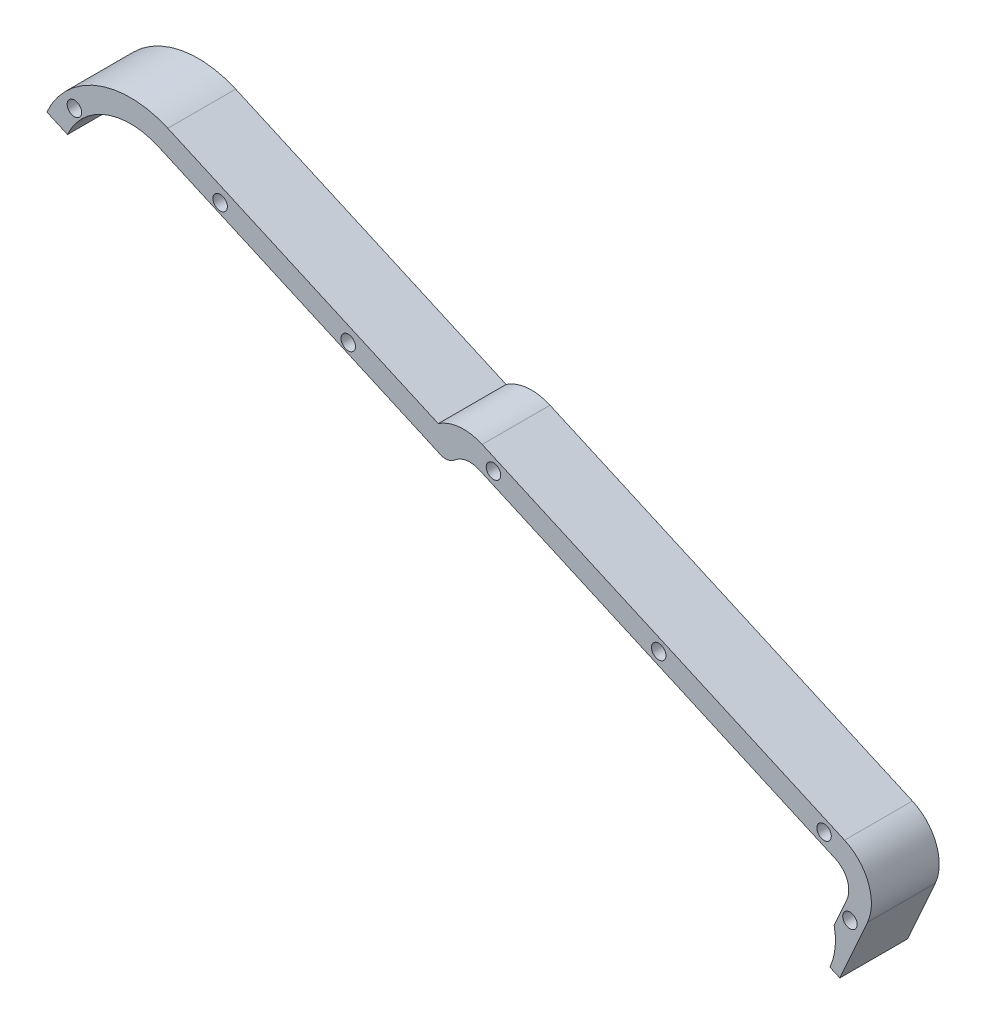
ISO-10303-21;
HEADER;
FILE_DESCRIPTION(('STEP AP214'),'2;1');
FILE_NAME('part.step','',(''),(''),'','','');
FILE_SCHEMA(('AUTOMOTIVE_DESIGN { 1 0 10303 214 1 1 1 1 }'));
ENDSEC;
DATA;
#1=APPLICATION_CONTEXT('core data for automotive mechanical design processes');
#2=APPLICATION_PROTOCOL_DEFINITION('international standard','automotive_design',2000,#1);
#3=PRODUCT_CONTEXT('',#1,'mechanical');
#4=PRODUCT('Part','Part','',(#3));
#5=PRODUCT_RELATED_PRODUCT_CATEGORY('part','',(#4));
#6=PRODUCT_DEFINITION_FORMATION('','',#4);
#7=PRODUCT_DEFINITION_CONTEXT('part definition',#1,'design');
#8=PRODUCT_DEFINITION('design','',#6,#7);
#9=PRODUCT_DEFINITION_SHAPE('','',#8);
#10=(LENGTH_UNIT() NAMED_UNIT(*) SI_UNIT(.MILLI.,.METRE.));
#11=(NAMED_UNIT(*) PLANE_ANGLE_UNIT() SI_UNIT($,.RADIAN.));
#12=(NAMED_UNIT(*) SI_UNIT($,.STERADIAN.) SOLID_ANGLE_UNIT());
#13=UNCERTAINTY_MEASURE_WITH_UNIT(LENGTH_MEASURE(1.E-05),#10,'distance_accuracy_value','');
#14=(GEOMETRIC_REPRESENTATION_CONTEXT(3) GLOBAL_UNCERTAINTY_ASSIGNED_CONTEXT((#13)) GLOBAL_UNIT_ASSIGNED_CONTEXT((#10,
#11,#12)) REPRESENTATION_CONTEXT('',''));
#15=CARTESIAN_POINT('',(0.,0.,0.));
#16=DIRECTION('',(0.,0.,1.));
#17=DIRECTION('',(1.,0.,0.));
#18=AXIS2_PLACEMENT_3D('',#15,#16,#17);
#19=CARTESIAN_POINT('',(-76.7868238041878,81.7037234737728,0.));
#20=DIRECTION('',(0.,0.,1.));
#21=DIRECTION('',(1.,0.,0.));
#22=AXIS2_PLACEMENT_3D('',#19,#20,#21);
#23=CYLINDRICAL_SURFACE('',#22,5.00000000000001);
#24=CARTESIAN_POINT('',(-76.7868238041878,81.7037234737728,15.));
#25=DIRECTION('',(0.,0.,-1.));
#26=DIRECTION('',(-1.,0.,0.));
#27=AXIS2_PLACEMENT_3D('',#24,#25,#26);
#28=CIRCLE('',#27,5.00000000000001);
#29=CARTESIAN_POINT('',(-74.7510627846422,86.27052509759,15.));
#30=VERTEX_POINT('',#29);
#31=CARTESIAN_POINT('',(-72.2200221803707,79.6679624542272,15.));
#32=VERTEX_POINT('',#31);
#33=EDGE_CURVE('E180',#30,#32,#28,.T.);
#34=ORIENTED_EDGE('',*,*,#33,.F.);
#35=DIRECTION('',(0.,0.,1.));
#36=VECTOR('',#35,1.);
#37=CARTESIAN_POINT('',(-74.7510627846422,86.27052509759,0.));
#38=LINE('',#37,#36);
#39=CARTESIAN_POINT('',(-74.7510627846422,86.27052509759,0.));
#40=VERTEX_POINT('',#39);
#41=EDGE_CURVE('E11',#40,#30,#38,.T.);
#42=ORIENTED_EDGE('',*,*,#41,.F.);
#43=CARTESIAN_POINT('',(-76.7868238041878,81.7037234737728,0.));
#44=DIRECTION('',(0.,0.,-1.));
#45=DIRECTION('',(-1.,0.,0.));
#46=AXIS2_PLACEMENT_3D('',#43,#44,#45);
#47=CIRCLE('',#46,5.00000000000001);
#48=CARTESIAN_POINT('',(-72.2200221803707,79.6679624542272,0.));
#49=VERTEX_POINT('',#48);
#50=EDGE_CURVE('E225',#40,#49,#47,.T.);
#51=ORIENTED_EDGE('',*,*,#50,.T.);
#52=DIRECTION('',(0.,0.,1.));
#53=VECTOR('',#52,1.);
#54=CARTESIAN_POINT('',(-72.2200221803707,79.6679624542272,0.));
#55=LINE('',#54,#53);
#56=EDGE_CURVE('E38',#49,#32,#55,.T.);
#57=ORIENTED_EDGE('',*,*,#56,.T.);
#58=EDGE_LOOP('',(#34,#42,#51,#57));
#59=FACE_BOUND('',#58,.T.);
#60=ADVANCED_FACE('F35',(#59),#23,.F.);
#61=CARTESIAN_POINT('',(-153.49279007904,121.371532814155,0.));
#62=DIRECTION('',(-0.40715220390912,-0.913360324763424,0.));
#63=DIRECTION('',(0.913360324763424,-0.40715220390912,0.));
#64=AXIS2_PLACEMENT_3D('',#61,#62,#63);
#65=PLANE('',#64);
#66=DIRECTION('',(0.913360324763424,-0.40715220390912,0.));
#67=VECTOR('',#66,1.);
#68=CARTESIAN_POINT('',(-153.49279007904,121.371532814155,15.));
#69=LINE('',#68,#67);
#70=CARTESIAN_POINT('',(-153.49279007904,121.371532814155,15.));
#71=VERTEX_POINT('',#70);
#72=EDGE_CURVE('E223',#71,#30,#69,.T.);
#73=ORIENTED_EDGE('',*,*,#72,.F.);
#74=DIRECTION('',(0.,0.,1.));
#75=VECTOR('',#74,1.);
#76=CARTESIAN_POINT('',(-153.49279007904,121.371532814155,0.));
#77=LINE('',#76,#75);
#78=CARTESIAN_POINT('',(-153.49279007904,121.371532814155,0.));
#79=VERTEX_POINT('',#78);
#80=EDGE_CURVE('E44',#79,#71,#77,.T.);
#81=ORIENTED_EDGE('',*,*,#80,.F.);
#82=DIRECTION('',(0.913360324763424,-0.40715220390912,0.));
#83=VECTOR('',#82,1.);
#84=CARTESIAN_POINT('',(-153.49279007904,121.371532814155,0.));
#85=LINE('',#84,#83);
#86=EDGE_CURVE('E170',#79,#40,#85,.T.);
#87=ORIENTED_EDGE('',*,*,#86,.T.);
#88=ORIENTED_EDGE('',*,*,#41,.T.);
#89=EDGE_LOOP('',(#73,#81,#87,#88));
#90=FACE_BOUND('',#89,.T.);
#91=ADVANCED_FACE('F253',(#90),#65,.T.);
#92=CARTESIAN_POINT('',(-155.528551098586,116.804731190338,0.));
#93=DIRECTION('',(0.,0.,1.));
#94=DIRECTION('',(1.,0.,0.));
#95=AXIS2_PLACEMENT_3D('',#92,#93,#94);
#96=CYLINDRICAL_SURFACE('',#95,5.00000000000001);
#97=CARTESIAN_POINT('',(-155.528551098586,116.804731190338,15.));
#98=DIRECTION('',(0.,0.,-1.));
#99=DIRECTION('',(-1.,0.,0.));
#100=AXIS2_PLACEMENT_3D('',#97,#98,#99);
#101=CIRCLE('',#100,5.00000000000001);
#102=CARTESIAN_POINT('',(-158.874492831978,120.520195349328,15.));
#103=VERTEX_POINT('',#102);
#104=EDGE_CURVE('E157',#103,#71,#101,.T.);
#105=ORIENTED_EDGE('',*,*,#104,.F.);
#106=DIRECTION('',(0.,0.,1.));
#107=VECTOR('',#106,1.);
#108=CARTESIAN_POINT('',(-158.874492831978,120.520195349328,0.));
#109=LINE('',#108,#107);
#110=CARTESIAN_POINT('',(-158.874492831978,120.520195349328,0.));
#111=VERTEX_POINT('',#110);
#112=EDGE_CURVE('E152',#111,#103,#109,.T.);
#113=ORIENTED_EDGE('',*,*,#112,.F.);
#114=CARTESIAN_POINT('',(-155.528551098586,116.804731190338,0.));
#115=DIRECTION('',(0.,0.,-1.));
#116=DIRECTION('',(-1.,0.,0.));
#117=AXIS2_PLACEMENT_3D('',#114,#115,#116);
#118=CIRCLE('',#117,5.00000000000001);
#119=EDGE_CURVE('E155',#111,#79,#118,.T.);
#120=ORIENTED_EDGE('',*,*,#119,.T.);
#121=ORIENTED_EDGE('',*,*,#80,.T.);
#122=EDGE_LOOP('',(#105,#113,#120,#121));
#123=FACE_BOUND('',#122,.T.);
#124=ADVANCED_FACE('F154',(#123),#96,.F.);
#125=CARTESIAN_POINT('',(-160.882057872014,122.749473844722,0.));
#126=DIRECTION('',(0.,0.,1.));
#127=DIRECTION('',(1.,0.,0.));
#128=AXIS2_PLACEMENT_3D('',#125,#126,#127);
#129=CYLINDRICAL_SURFACE('',#128,3.);
#130=CARTESIAN_POINT('',(-160.882057872014,122.749473844722,15.));
#131=DIRECTION('',(0.,0.,1.));
#132=DIRECTION('',(1.,0.,0.));
#133=AXIS2_PLACEMENT_3D('',#130,#131,#132);
#134=CIRCLE('',#133,3.);
#135=CARTESIAN_POINT('',(-162.103514483741,120.009392870432,15.));
#136=VERTEX_POINT('',#135);
#137=EDGE_CURVE('E220',#136,#103,#134,.T.);
#138=ORIENTED_EDGE('',*,*,#137,.F.);
#139=DIRECTION('',(0.,0.,1.));
#140=VECTOR('',#139,1.);
#141=CARTESIAN_POINT('',(-162.103514483741,120.009392870432,0.));
#142=LINE('',#141,#140);
#143=CARTESIAN_POINT('',(-162.103514483741,120.009392870432,0.));
#144=VERTEX_POINT('',#143);
#145=EDGE_CURVE('E162',#144,#136,#142,.T.);
#146=ORIENTED_EDGE('',*,*,#145,.F.);
#147=CARTESIAN_POINT('',(-160.882057872014,122.749473844722,0.));
#148=DIRECTION('',(0.,0.,1.));
#149=DIRECTION('',(1.,0.,0.));
#150=AXIS2_PLACEMENT_3D('',#147,#148,#149);
#151=CIRCLE('',#150,3.);
#152=EDGE_CURVE('E168',#144,#111,#151,.T.);
#153=ORIENTED_EDGE('',*,*,#152,.T.);
#154=ORIENTED_EDGE('',*,*,#112,.T.);
#155=EDGE_LOOP('',(#138,#146,#153,#154));
#156=FACE_BOUND('',#155,.T.);
#157=ADVANCED_FACE('F172',(#156),#129,.T.);
#158=CARTESIAN_POINT('',(-224.335121241539,147.750619588163,0.));
#159=DIRECTION('',(-0.40715220390912,-0.913360324763423,0.));
#160=DIRECTION('',(0.913360324763423,-0.40715220390912,0.));
#161=AXIS2_PLACEMENT_3D('',#158,#159,#160);
#162=PLANE('',#161);
#163=DIRECTION('',(0.913360324763423,-0.40715220390912,0.));
#164=VECTOR('',#163,1.);
#165=CARTESIAN_POINT('',(-224.335121241539,147.750619588163,15.));
#166=LINE('',#165,#164);
#167=CARTESIAN_POINT('',(-224.335121241539,147.750619588163,15.));
#168=VERTEX_POINT('',#167);
#169=EDGE_CURVE('E217',#168,#136,#166,.T.);
#170=ORIENTED_EDGE('',*,*,#169,.F.);
#171=DIRECTION('',(0.,0.,1.));
#172=VECTOR('',#171,1.);
#173=CARTESIAN_POINT('',(-224.335121241539,147.750619588163,0.));
#174=LINE('',#173,#172);
#175=CARTESIAN_POINT('',(-224.335121241539,147.750619588163,0.));
#176=VERTEX_POINT('',#175);
#177=EDGE_CURVE('E229',#176,#168,#174,.T.);
#178=ORIENTED_EDGE('',*,*,#177,.F.);
#179=DIRECTION('',(0.913360324763423,-0.40715220390912,0.));
#180=VECTOR('',#179,1.);
#181=CARTESIAN_POINT('',(-224.335121241539,147.750619588163,0.));
#182=LINE('',#181,#180);
#183=EDGE_CURVE('E173',#176,#144,#182,.T.);
#184=ORIENTED_EDGE('',*,*,#183,.T.);
#185=ORIENTED_EDGE('',*,*,#145,.T.);
#186=EDGE_LOOP('',(#170,#178,#184,#185));
#187=FACE_BOUND('',#186,.T.);
#188=ADVANCED_FACE('F266',(#187),#162,.T.);
#189=CARTESIAN_POINT('',(-230.544192351153,133.821874635521,0.));
#190=DIRECTION('',(0.,0.,1.));
#191=DIRECTION('',(1.,0.,0.));
#192=AXIS2_PLACEMENT_3D('',#189,#190,#191);
#193=CYLINDRICAL_SURFACE('',#192,15.25);
#194=CARTESIAN_POINT('',(-230.544192351153,133.821874635521,15.));
#195=DIRECTION('',(0.,0.,-1.));
#196=DIRECTION('',(-1.,0.,0.));
#197=AXIS2_PLACEMENT_3D('',#194,#195,#196);
#198=CIRCLE('',#197,15.25);
#199=CARTESIAN_POINT('',(-244.472937303795,140.030945745135,15.));
#200=VERTEX_POINT('',#199);
#201=EDGE_CURVE('E214',#200,#168,#198,.T.);
#202=ORIENTED_EDGE('',*,*,#201,.F.);
#203=DIRECTION('',(0.,0.,1.));
#204=VECTOR('',#203,1.);
#205=CARTESIAN_POINT('',(-244.472937303795,140.030945745135,0.));
#206=LINE('',#205,#204);
#207=CARTESIAN_POINT('',(-244.472937303795,140.030945745135,0.));
#208=VERTEX_POINT('',#207);
#209=EDGE_CURVE('E231',#208,#200,#206,.T.);
#210=ORIENTED_EDGE('',*,*,#209,.F.);
#211=CARTESIAN_POINT('',(-230.544192351153,133.821874635521,0.));
#212=DIRECTION('',(0.,0.,-1.));
#213=DIRECTION('',(-1.,0.,0.));
#214=AXIS2_PLACEMENT_3D('',#211,#212,#213);
#215=CIRCLE('',#214,15.25);
#216=EDGE_CURVE('E175',#208,#176,#215,.T.);
#217=ORIENTED_EDGE('',*,*,#216,.T.);
#218=ORIENTED_EDGE('',*,*,#177,.T.);
#219=EDGE_LOOP('',(#202,#210,#217,#218));
#220=FACE_BOUND('',#219,.T.);
#221=ADVANCED_FACE('F269',(#220),#193,.F.);
#222=CARTESIAN_POINT('',(-249.039738927612,142.066706764681,0.));
#223=DIRECTION('',(-0.407152203909127,-0.913360324763421,0.));
#224=DIRECTION('',(0.913360324763421,-0.407152203909127,0.));
#225=AXIS2_PLACEMENT_3D('',#222,#223,#224);
#226=PLANE('',#225);
#227=DIRECTION('',(0.91336032476342,-0.407152203909127,0.));
#228=VECTOR('',#227,1.);
#229=CARTESIAN_POINT('',(-249.039738927612,142.066706764681,15.));
#230=LINE('',#229,#228);
#231=CARTESIAN_POINT('',(-249.039738927612,142.066706764681,15.));
#232=VERTEX_POINT('',#231);
#233=EDGE_CURVE('E211',#232,#200,#230,.T.);
#234=ORIENTED_EDGE('',*,*,#233,.F.);
#235=DIRECTION('',(0.,0.,1.));
#236=VECTOR('',#235,1.);
#237=CARTESIAN_POINT('',(-249.039738927612,142.066706764681,0.));
#238=LINE('',#237,#236);
#239=CARTESIAN_POINT('',(-249.039738927612,142.066706764681,0.));
#240=VERTEX_POINT('',#239);
#241=EDGE_CURVE('E233',#240,#232,#238,.T.);
#242=ORIENTED_EDGE('',*,*,#241,.F.);
#243=DIRECTION('',(0.91336032476342,-0.407152203909127,0.));
#244=VECTOR('',#243,1.);
#245=CARTESIAN_POINT('',(-249.039738927612,142.066706764681,0.));
#246=LINE('',#245,#244);
#247=EDGE_CURVE('E421',#240,#208,#246,.T.);
#248=ORIENTED_EDGE('',*,*,#247,.T.);
#249=ORIENTED_EDGE('',*,*,#209,.T.);
#250=EDGE_LOOP('',(#234,#242,#248,#249));
#251=FACE_BOUND('',#250,.T.);
#252=ADVANCED_FACE('F273',(#251),#226,.T.);
#253=CARTESIAN_POINT('',(-230.544192351153,133.821874635521,0.));
#254=DIRECTION('',(0.,0.,1.));
#255=DIRECTION('',(1.,0.,0.));
#256=AXIS2_PLACEMENT_3D('',#253,#254,#255);
#257=CYLINDRICAL_SURFACE('',#256,20.25);
#258=CARTESIAN_POINT('',(-230.544192351153,133.821874635521,15.));
#259=DIRECTION('',(0.,0.,1.));
#260=DIRECTION('',(1.,0.,0.));
#261=AXIS2_PLACEMENT_3D('',#258,#259,#260);
#262=CIRCLE('',#261,20.25);
#263=CARTESIAN_POINT('',(-222.299360221993,152.317421211981,15.));
#264=VERTEX_POINT('',#263);
#265=EDGE_CURVE('E208',#264,#232,#262,.T.);
#266=ORIENTED_EDGE('',*,*,#265,.F.);
#267=DIRECTION('',(0.,0.,1.));
#268=VECTOR('',#267,1.);
#269=CARTESIAN_POINT('',(-222.299360221993,152.317421211981,0.));
#270=LINE('',#269,#268);
#271=CARTESIAN_POINT('',(-222.299360221993,152.317421211981,0.));
#272=VERTEX_POINT('',#271);
#273=EDGE_CURVE('E235',#272,#264,#270,.T.);
#274=ORIENTED_EDGE('',*,*,#273,.F.);
#275=CARTESIAN_POINT('',(-230.544192351153,133.821874635521,0.));
#276=DIRECTION('',(0.,0.,1.));
#277=DIRECTION('',(1.,0.,0.));
#278=AXIS2_PLACEMENT_3D('',#275,#276,#277);
#279=CIRCLE('',#278,20.25);
#280=EDGE_CURVE('E418',#272,#240,#279,.T.);
#281=ORIENTED_EDGE('',*,*,#280,.T.);
#282=ORIENTED_EDGE('',*,*,#241,.T.);
#283=EDGE_LOOP('',(#266,#274,#281,#282));
#284=FACE_BOUND('',#283,.T.);
#285=ADVANCED_FACE('F277',(#284),#257,.T.);
#286=CARTESIAN_POINT('',(-162.524605275697,125.671394934437,0.));
#287=DIRECTION('',(0.407152203909121,0.913360324763423,0.));
#288=DIRECTION('',(-0.913360324763423,0.407152203909121,0.));
#289=AXIS2_PLACEMENT_3D('',#286,#287,#288);
#290=PLANE('',#289);
#291=DIRECTION('',(-0.913360324763423,0.407152203909121,0.));
#292=VECTOR('',#291,1.);
#293=CARTESIAN_POINT('',(-162.524605275697,125.671394934437,15.));
#294=LINE('',#293,#292);
#295=CARTESIAN_POINT('',(-162.524605275697,125.671394934437,15.));
#296=VERTEX_POINT('',#295);
#297=EDGE_CURVE('E205',#296,#264,#294,.T.);
#298=ORIENTED_EDGE('',*,*,#297,.F.);
#299=DIRECTION('',(0.,0.,1.));
#300=VECTOR('',#299,1.);
#301=CARTESIAN_POINT('',(-162.524605275697,125.671394934437,0.));
#302=LINE('',#301,#300);
#303=CARTESIAN_POINT('',(-162.524605275697,125.671394934437,0.));
#304=VERTEX_POINT('',#303);
#305=EDGE_CURVE('E237',#304,#296,#302,.T.);
#306=ORIENTED_EDGE('',*,*,#305,.F.);
#307=DIRECTION('',(-0.913360324763423,0.407152203909121,0.));
#308=VECTOR('',#307,1.);
#309=CARTESIAN_POINT('',(-162.524605275697,125.671394934437,0.));
#310=LINE('',#309,#308);
#311=EDGE_CURVE('E415',#304,#272,#310,.T.);
#312=ORIENTED_EDGE('',*,*,#311,.T.);
#313=ORIENTED_EDGE('',*,*,#273,.T.);
#314=EDGE_LOOP('',(#298,#306,#312,#313));
#315=FACE_BOUND('',#314,.T.);
#316=ADVANCED_FACE('F281',(#315),#290,.T.);
#317=CARTESIAN_POINT('',(-156.88852428594,117.410971756603,0.));
#318=DIRECTION('',(0.,0.,1.));
#319=DIRECTION('',(1.,0.,0.));
#320=AXIS2_PLACEMENT_3D('',#317,#318,#319);
#321=CYLINDRICAL_SURFACE('',#320,10.);
#322=CARTESIAN_POINT('',(-156.88852428594,117.410971756603,15.));
#323=DIRECTION('',(0.,0.,1.));
#324=DIRECTION('',(1.,0.,0.));
#325=AXIS2_PLACEMENT_3D('',#322,#323,#324);
#326=CIRCLE('',#325,10.);
#327=CARTESIAN_POINT('',(-152.817002246849,126.544575004237,15.));
#328=VERTEX_POINT('',#327);
#329=EDGE_CURVE('E202',#328,#296,#326,.T.);
#330=ORIENTED_EDGE('',*,*,#329,.F.);
#331=DIRECTION('',(0.,0.,1.));
#332=VECTOR('',#331,1.);
#333=CARTESIAN_POINT('',(-152.817002246849,126.544575004237,0.));
#334=LINE('',#333,#332);
#335=CARTESIAN_POINT('',(-152.817002246849,126.544575004237,0.));
#336=VERTEX_POINT('',#335);
#337=EDGE_CURVE('E239',#336,#328,#334,.T.);
#338=ORIENTED_EDGE('',*,*,#337,.F.);
#339=CARTESIAN_POINT('',(-156.88852428594,117.410971756603,0.));
#340=DIRECTION('',(0.,0.,1.));
#341=DIRECTION('',(1.,0.,0.));
#342=AXIS2_PLACEMENT_3D('',#339,#340,#341);
#343=CIRCLE('',#342,10.);
#344=EDGE_CURVE('E412',#336,#304,#343,.T.);
#345=ORIENTED_EDGE('',*,*,#344,.T.);
#346=ORIENTED_EDGE('',*,*,#305,.T.);
#347=EDGE_LOOP('',(#330,#338,#345,#346));
#348=FACE_BOUND('',#347,.T.);
#349=ADVANCED_FACE('F285',(#348),#321,.T.);
#350=CARTESIAN_POINT('',(-72.7153017650966,90.837326721407,0.));
#351=DIRECTION('',(0.40715220390912,0.913360324763423,0.));
#352=DIRECTION('',(-0.913360324763423,0.40715220390912,0.));
#353=AXIS2_PLACEMENT_3D('',#350,#351,#352);
#354=PLANE('',#353);
#355=DIRECTION('',(-0.913360324763423,0.40715220390912,0.));
#356=VECTOR('',#355,1.);
#357=CARTESIAN_POINT('',(-72.7153017650966,90.837326721407,15.));
#358=LINE('',#357,#356);
#359=CARTESIAN_POINT('',(-72.7153017650967,90.8373267214067,15.));
#360=VERTEX_POINT('',#359);
#361=EDGE_CURVE('E199',#360,#328,#358,.T.);
#362=ORIENTED_EDGE('',*,*,#361,.F.);
#363=DIRECTION('',(0.,0.,1.));
#364=VECTOR('',#363,1.);
#365=CARTESIAN_POINT('',(-72.7153017650967,90.8373267214067,0.));
#366=LINE('',#365,#364);
#367=CARTESIAN_POINT('',(-72.7153017650967,90.8373267214067,0.));
#368=VERTEX_POINT('',#367);
#369=EDGE_CURVE('E241',#368,#360,#366,.T.);
#370=ORIENTED_EDGE('',*,*,#369,.F.);
#371=DIRECTION('',(-0.913360324763423,0.40715220390912,0.));
#372=VECTOR('',#371,1.);
#373=CARTESIAN_POINT('',(-72.7153017650966,90.837326721407,0.));
#374=LINE('',#373,#372);
#375=EDGE_CURVE('E409',#368,#336,#374,.T.);
#376=ORIENTED_EDGE('',*,*,#375,.T.);
#377=ORIENTED_EDGE('',*,*,#337,.T.);
#378=EDGE_LOOP('',(#362,#370,#376,#377));
#379=FACE_BOUND('',#378,.T.);
#380=ADVANCED_FACE('F289',(#379),#354,.T.);
#381=CARTESIAN_POINT('',(-76.7868238041878,81.7037234737728,0.));
#382=DIRECTION('',(0.,0.,1.));
#383=DIRECTION('',(1.,0.,0.));
#384=AXIS2_PLACEMENT_3D('',#381,#382,#383);
#385=CYLINDRICAL_SURFACE('',#384,9.99999999999968);
#386=CARTESIAN_POINT('',(-76.7868238041878,81.7037234737728,15.));
#387=DIRECTION('',(0.,0.,1.));
#388=DIRECTION('',(1.,0.,0.));
#389=AXIS2_PLACEMENT_3D('',#386,#387,#388);
#390=CIRCLE('',#389,9.99999999999968);
#391=CARTESIAN_POINT('',(-67.6532205565541,77.6322014346818,15.));
#392=VERTEX_POINT('',#391);
#393=EDGE_CURVE('E196',#392,#360,#390,.T.);
#394=ORIENTED_EDGE('',*,*,#393,.F.);
#395=DIRECTION('',(0.,0.,1.));
#396=VECTOR('',#395,1.);
#397=CARTESIAN_POINT('',(-67.6532205565541,77.6322014346818,0.));
#398=LINE('',#397,#396);
#399=CARTESIAN_POINT('',(-67.6532205565541,77.6322014346818,0.));
#400=VERTEX_POINT('',#399);
#401=EDGE_CURVE('E243',#400,#392,#398,.T.);
#402=ORIENTED_EDGE('',*,*,#401,.F.);
#403=CARTESIAN_POINT('',(-76.7868238041878,81.7037234737728,0.));
#404=DIRECTION('',(0.,0.,1.));
#405=DIRECTION('',(1.,0.,0.));
#406=AXIS2_PLACEMENT_3D('',#403,#404,#405);
#407=CIRCLE('',#406,9.99999999999968);
#408=EDGE_CURVE('E406',#400,#368,#407,.T.);
#409=ORIENTED_EDGE('',*,*,#408,.T.);
#410=ORIENTED_EDGE('',*,*,#369,.T.);
#411=EDGE_LOOP('',(#394,#402,#409,#410));
#412=FACE_BOUND('',#411,.T.);
#413=ADVANCED_FACE('F293',(#412),#385,.T.);
#414=CARTESIAN_POINT('',(-73.7605036151916,63.9317965632293,0.));
#415=DIRECTION('',(0.91336032476342,-0.407152203909127,0.));
#416=DIRECTION('',(0.407152203909127,0.91336032476342,0.));
#417=AXIS2_PLACEMENT_3D('',#414,#415,#416);
#418=PLANE('',#417);
#419=DIRECTION('',(0.407152203909127,0.91336032476342,0.));
#420=VECTOR('',#419,1.);
#421=CARTESIAN_POINT('',(-73.7605036151916,63.9317965632293,15.));
#422=LINE('',#421,#420);
#423=CARTESIAN_POINT('',(-73.7605036151916,63.9317965632293,15.));
#424=VERTEX_POINT('',#423);
#425=EDGE_CURVE('E193',#424,#392,#422,.T.);
#426=ORIENTED_EDGE('',*,*,#425,.F.);
#427=DIRECTION('',(0.,0.,1.));
#428=VECTOR('',#427,1.);
#429=CARTESIAN_POINT('',(-73.7605036151916,63.9317965632293,0.));
#430=LINE('',#429,#428);
#431=CARTESIAN_POINT('',(-73.7605036151916,63.9317965632293,0.));
#432=VERTEX_POINT('',#431);
#433=EDGE_CURVE('E245',#432,#424,#430,.T.);
#434=ORIENTED_EDGE('',*,*,#433,.F.);
#435=DIRECTION('',(0.407152203909127,0.91336032476342,0.));
#436=VECTOR('',#435,1.);
#437=CARTESIAN_POINT('',(-73.7605036151916,63.9317965632293,0.));
#438=LINE('',#437,#436);
#439=EDGE_CURVE('E403',#432,#400,#438,.T.);
#440=ORIENTED_EDGE('',*,*,#439,.T.);
#441=ORIENTED_EDGE('',*,*,#401,.T.);
#442=EDGE_LOOP('',(#426,#434,#440,#441));
#443=FACE_BOUND('',#442,.T.);
#444=ADVANCED_FACE('F297',(#443),#418,.T.);
#445=CARTESIAN_POINT('',(-75.9417065742245,64.9041199364538,0.));
#446=DIRECTION('',(-0.407152203909127,-0.91336032476342,0.));
#447=DIRECTION('',(0.91336032476342,-0.407152203909127,0.));
#448=AXIS2_PLACEMENT_3D('',#445,#446,#447);
#449=PLANE('',#448);
#450=DIRECTION('',(0.91336032476342,-0.407152203909127,0.));
#451=VECTOR('',#450,1.);
#452=CARTESIAN_POINT('',(-75.9417065742245,64.9041199364538,15.));
#453=LINE('',#452,#451);
#454=CARTESIAN_POINT('',(-75.9417065742242,64.9041199364537,15.));
#455=VERTEX_POINT('',#454);
#456=EDGE_CURVE('E190',#455,#424,#453,.T.);
#457=ORIENTED_EDGE('',*,*,#456,.F.);
#458=DIRECTION('',(0.,0.,1.));
#459=VECTOR('',#458,1.);
#460=CARTESIAN_POINT('',(-75.9417065742242,64.9041199364537,0.));
#461=LINE('',#460,#459);
#462=CARTESIAN_POINT('',(-75.9417065742242,64.9041199364537,0.));
#463=VERTEX_POINT('',#462);
#464=EDGE_CURVE('E247',#463,#455,#461,.T.);
#465=ORIENTED_EDGE('',*,*,#464,.F.);
#466=DIRECTION('',(0.91336032476342,-0.407152203909127,0.));
#467=VECTOR('',#466,1.);
#468=CARTESIAN_POINT('',(-75.9417065742245,64.9041199364538,0.));
#469=LINE('',#468,#467);
#470=EDGE_CURVE('E400',#463,#432,#469,.T.);
#471=ORIENTED_EDGE('',*,*,#470,.T.);
#472=ORIENTED_EDGE('',*,*,#433,.T.);
#473=EDGE_LOOP('',(#457,#465,#471,#472));
#474=FACE_BOUND('',#473,.T.);
#475=ADVANCED_FACE('F301',(#474),#449,.T.);
#476=CARTESIAN_POINT('',(-88.7287511209124,70.6042507911816,0.));
#477=DIRECTION('',(0.,0.,1.));
#478=DIRECTION('',(1.,0.,0.));
#479=AXIS2_PLACEMENT_3D('',#476,#477,#478);
#480=CYLINDRICAL_SURFACE('',#479,14.0000000000003);
#481=CARTESIAN_POINT('',(-88.7287511209124,70.6042507911816,15.));
#482=DIRECTION('',(0.,0.,-1.));
#483=DIRECTION('',(-1.,0.,0.));
#484=AXIS2_PLACEMENT_3D('',#481,#482,#483);
#485=CIRCLE('',#484,14.0000000000003);
#486=CARTESIAN_POINT('',(-75.0118010764204,73.4051937532801,15.));
#487=VERTEX_POINT('',#486);
#488=EDGE_CURVE('E187',#487,#455,#485,.T.);
#489=ORIENTED_EDGE('',*,*,#488,.F.);
#490=DIRECTION('',(0.,0.,1.));
#491=VECTOR('',#490,1.);
#492=CARTESIAN_POINT('',(-75.0118010764204,73.4051937532801,0.));
#493=LINE('',#492,#491);
#494=CARTESIAN_POINT('',(-75.0118010764204,73.4051937532801,0.));
#495=VERTEX_POINT('',#494);
#496=EDGE_CURVE('E248',#495,#487,#493,.T.);
#497=ORIENTED_EDGE('',*,*,#496,.F.);
#498=CARTESIAN_POINT('',(-88.7287511209124,70.6042507911816,0.));
#499=DIRECTION('',(0.,0.,-1.));
#500=DIRECTION('',(-1.,0.,0.));
#501=AXIS2_PLACEMENT_3D('',#498,#499,#500);
#502=CIRCLE('',#501,14.0000000000003);
#503=EDGE_CURVE('E397',#495,#463,#502,.T.);
#504=ORIENTED_EDGE('',*,*,#503,.T.);
#505=ORIENTED_EDGE('',*,*,#464,.T.);
#506=EDGE_LOOP('',(#489,#497,#504,#505));
#507=FACE_BOUND('',#506,.T.);
#508=ADVANCED_FACE('F305',(#507),#480,.F.);
#509=CARTESIAN_POINT('',(-72.2200221803707,79.6679624542272,0.));
#510=DIRECTION('',(-0.913360324763424,0.407152203909119,0.));
#511=DIRECTION('',(-0.407152203909119,-0.913360324763424,0.));
#512=AXIS2_PLACEMENT_3D('',#509,#510,#511);
#513=PLANE('',#512);
#514=DIRECTION('',(-0.407152203909119,-0.913360324763424,0.));
#515=VECTOR('',#514,1.);
#516=CARTESIAN_POINT('',(-72.2200221803707,79.6679624542272,15.));
#517=LINE('',#516,#515);
#518=EDGE_CURVE('E183',#32,#487,#517,.T.);
#519=ORIENTED_EDGE('',*,*,#518,.F.);
#520=ORIENTED_EDGE('',*,*,#56,.F.);
#521=DIRECTION('',(-0.407152203909119,-0.913360324763424,0.));
#522=VECTOR('',#521,1.);
#523=CARTESIAN_POINT('',(-72.2200221803707,79.6679624542272,0.));
#524=LINE('',#523,#522);
#525=EDGE_CURVE('E395',#49,#495,#524,.T.);
#526=ORIENTED_EDGE('',*,*,#525,.T.);
#527=ORIENTED_EDGE('',*,*,#496,.T.);
#528=EDGE_LOOP('',(#519,#520,#526,#527));
#529=FACE_BOUND('',#528,.T.);
#530=ADVANCED_FACE('F250',(#529),#513,.T.);
#531=CARTESIAN_POINT('',(-76.7868238041878,81.7037234737728,0.));
#532=DIRECTION('',(0.,0.,-1.));
#533=DIRECTION('',(-1.,0.,0.));
#534=AXIS2_PLACEMENT_3D('',#531,#532,#533);
#535=PLANE('',#534);
#536=CARTESIAN_POINT('',(-242.947351213455,145.810375385677,0.));
#537=DIRECTION('',(0.,0.,1.));
#538=DIRECTION('',(-1.,0.,0.));
#539=AXIS2_PLACEMENT_3D('',#536,#537,#538);
#540=CIRCLE('',#539,1.59999999999999);
#541=CARTESIAN_POINT('',(-244.547351213455,145.810375385677,0.));
#542=VERTEX_POINT('',#541);
#543=EDGE_CURVE('E352',#542,#542,#540,.T.);
#544=ORIENTED_EDGE('',*,*,#543,.T.);
#545=EDGE_LOOP('',(#544));
#546=FACE_BOUND('',#545,.T.);
#547=CARTESIAN_POINT('',(-182.419602219367,131.25549106178,0.));
#548=DIRECTION('',(0.,0.,1.));
#549=DIRECTION('',(-1.,0.,0.));
#550=AXIS2_PLACEMENT_3D('',#547,#548,#549);
#551=CIRCLE('',#550,1.59999999999999);
#552=CARTESIAN_POINT('',(-184.019602219367,131.25549106178,0.));
#553=VERTEX_POINT('',#552);
#554=EDGE_CURVE('E360',#553,#553,#551,.T.);
#555=ORIENTED_EDGE('',*,*,#554,.T.);
#556=EDGE_LOOP('',(#555));
#557=FACE_BOUND('',#556,.T.);
#558=CARTESIAN_POINT('',(-210.733772287033,143.877209382963,0.));
#559=DIRECTION('',(0.,0.,1.));
#560=DIRECTION('',(-1.,0.,0.));
#561=AXIS2_PLACEMENT_3D('',#558,#559,#560);
#562=CIRCLE('',#561,1.59999999999999);
#563=CARTESIAN_POINT('',(-212.333772287033,143.877209382963,0.));
#564=VERTEX_POINT('',#563);
#565=EDGE_CURVE('E366',#564,#564,#562,.T.);
#566=ORIENTED_EDGE('',*,*,#565,.T.);
#567=EDGE_LOOP('',(#566));
#568=FACE_BOUND('',#567,.T.);
#569=CARTESIAN_POINT('',(-71.5234221100948,76.0728618517278,0.));
#570=DIRECTION('',(0.,0.,1.));
#571=DIRECTION('',(-1.,0.,0.));
#572=AXIS2_PLACEMENT_3D('',#569,#570,#571);
#573=CIRCLE('',#572,1.6);
#574=CARTESIAN_POINT('',(-73.1234221100948,76.0728618517278,0.));
#575=VERTEX_POINT('',#574);
#576=EDGE_CURVE('E372',#575,#575,#573,.T.);
#577=ORIENTED_EDGE('',*,*,#576,.T.);
#578=EDGE_LOOP('',(#577));
#579=FACE_BOUND('',#578,.T.);
#580=CARTESIAN_POINT('',(-77.2496195252085,90.1214618945486,0.));
#581=DIRECTION('',(0.,0.,1.));
#582=DIRECTION('',(-1.,0.,0.));
#583=AXIS2_PLACEMENT_3D('',#580,#581,#582);
#584=CIRCLE('',#583,1.6);
#585=CARTESIAN_POINT('',(-78.8496195252085,90.1214618945486,0.));
#586=VERTEX_POINT('',#585);
#587=EDGE_CURVE('E378',#586,#586,#584,.T.);
#588=ORIENTED_EDGE('',*,*,#587,.T.);
#589=EDGE_LOOP('',(#588));
#590=FACE_BOUND('',#589,.T.);
#591=CARTESIAN_POINT('',(-150.318445506282,122.693638207278,0.));
#592=DIRECTION('',(0.,0.,1.));
#593=DIRECTION('',(-1.,0.,0.));
#594=AXIS2_PLACEMENT_3D('',#591,#592,#593);
#595=CIRCLE('',#594,1.59999999999999);
#596=CARTESIAN_POINT('',(-151.918445506282,122.693638207278,0.));
#597=VERTEX_POINT('',#596);
#598=EDGE_CURVE('E384',#597,#597,#595,.T.);
#599=ORIENTED_EDGE('',*,*,#598,.T.);
#600=EDGE_LOOP('',(#599));
#601=FACE_BOUND('',#600,.T.);
#602=CARTESIAN_POINT('',(-113.784032515745,106.407550050913,0.));
#603=DIRECTION('',(0.,0.,1.));
#604=DIRECTION('',(-1.,0.,0.));
#605=AXIS2_PLACEMENT_3D('',#602,#603,#604);
#606=CIRCLE('',#605,1.6);
#607=CARTESIAN_POINT('',(-115.384032515745,106.407550050913,0.));
#608=VERTEX_POINT('',#607);
#609=EDGE_CURVE('E184',#608,#608,#606,.T.);
#610=ORIENTED_EDGE('',*,*,#609,.T.);
#611=EDGE_LOOP('',(#610));
#612=FACE_BOUND('',#611,.T.);
#613=ORIENTED_EDGE('',*,*,#50,.F.);
#614=ORIENTED_EDGE('',*,*,#86,.F.);
#615=ORIENTED_EDGE('',*,*,#119,.F.);
#616=ORIENTED_EDGE('',*,*,#152,.F.);
#617=ORIENTED_EDGE('',*,*,#183,.F.);
#618=ORIENTED_EDGE('',*,*,#216,.F.);
#619=ORIENTED_EDGE('',*,*,#247,.F.);
#620=ORIENTED_EDGE('',*,*,#280,.F.);
#621=ORIENTED_EDGE('',*,*,#311,.F.);
#622=ORIENTED_EDGE('',*,*,#344,.F.);
#623=ORIENTED_EDGE('',*,*,#375,.F.);
#624=ORIENTED_EDGE('',*,*,#408,.F.);
#625=ORIENTED_EDGE('',*,*,#439,.F.);
#626=ORIENTED_EDGE('',*,*,#470,.F.);
#627=ORIENTED_EDGE('',*,*,#503,.F.);
#628=ORIENTED_EDGE('',*,*,#525,.F.);
#629=EDGE_LOOP('',(#613,#614,#615,#616,#617,#618,#619,#620,#621,#622,#623,#624,#625,#626,#627,#628));
#630=FACE_BOUND('',#629,.T.);
#631=ADVANCED_FACE('F166',(#546,#557,#568,#579,#590,#601,#612,#630),#535,.T.);
#632=CARTESIAN_POINT('',(-76.7868238041878,81.7037234737728,15.));
#633=DIRECTION('',(0.,0.,-1.));
#634=DIRECTION('',(-1.,0.,0.));
#635=AXIS2_PLACEMENT_3D('',#632,#633,#634);
#636=PLANE('',#635);
#637=CARTESIAN_POINT('',(-242.947351213455,145.810375385677,15.));
#638=DIRECTION('',(0.,0.,1.));
#639=DIRECTION('',(-1.,0.,0.));
#640=AXIS2_PLACEMENT_3D('',#637,#638,#639);
#641=CIRCLE('',#640,1.59999999999999);
#642=CARTESIAN_POINT('',(-244.547351213455,145.810375385677,15.));
#643=VERTEX_POINT('',#642);
#644=EDGE_CURVE('E355',#643,#643,#641,.T.);
#645=ORIENTED_EDGE('',*,*,#644,.F.);
#646=EDGE_LOOP('',(#645));
#647=FACE_BOUND('',#646,.T.);
#648=CARTESIAN_POINT('',(-182.419602219367,131.25549106178,15.));
#649=DIRECTION('',(0.,0.,1.));
#650=DIRECTION('',(-1.,0.,0.));
#651=AXIS2_PLACEMENT_3D('',#648,#649,#650);
#652=CIRCLE('',#651,1.59999999999999);
#653=CARTESIAN_POINT('',(-184.019602219367,131.25549106178,15.));
#654=VERTEX_POINT('',#653);
#655=EDGE_CURVE('E357',#654,#654,#652,.T.);
#656=ORIENTED_EDGE('',*,*,#655,.F.);
#657=EDGE_LOOP('',(#656));
#658=FACE_BOUND('',#657,.T.);
#659=CARTESIAN_POINT('',(-210.733772287033,143.877209382963,15.));
#660=DIRECTION('',(0.,0.,1.));
#661=DIRECTION('',(-1.,0.,0.));
#662=AXIS2_PLACEMENT_3D('',#659,#660,#661);
#663=CIRCLE('',#662,1.59999999999999);
#664=CARTESIAN_POINT('',(-212.333772287033,143.877209382963,15.));
#665=VERTEX_POINT('',#664);
#666=EDGE_CURVE('E363',#665,#665,#663,.T.);
#667=ORIENTED_EDGE('',*,*,#666,.F.);
#668=EDGE_LOOP('',(#667));
#669=FACE_BOUND('',#668,.T.);
#670=CARTESIAN_POINT('',(-71.5234221100948,76.0728618517278,15.));
#671=DIRECTION('',(0.,0.,1.));
#672=DIRECTION('',(-1.,0.,0.));
#673=AXIS2_PLACEMENT_3D('',#670,#671,#672);
#674=CIRCLE('',#673,1.6);
#675=CARTESIAN_POINT('',(-73.1234221100948,76.0728618517278,15.));
#676=VERTEX_POINT('',#675);
#677=EDGE_CURVE('E369',#676,#676,#674,.T.);
#678=ORIENTED_EDGE('',*,*,#677,.F.);
#679=EDGE_LOOP('',(#678));
#680=FACE_BOUND('',#679,.T.);
#681=CARTESIAN_POINT('',(-77.2496195252085,90.1214618945486,15.));
#682=DIRECTION('',(0.,0.,1.));
#683=DIRECTION('',(-1.,0.,0.));
#684=AXIS2_PLACEMENT_3D('',#681,#682,#683);
#685=CIRCLE('',#684,1.6);
#686=CARTESIAN_POINT('',(-78.8496195252085,90.1214618945486,15.));
#687=VERTEX_POINT('',#686);
#688=EDGE_CURVE('E375',#687,#687,#685,.T.);
#689=ORIENTED_EDGE('',*,*,#688,.F.);
#690=EDGE_LOOP('',(#689));
#691=FACE_BOUND('',#690,.T.);
#692=CARTESIAN_POINT('',(-150.318445506282,122.693638207278,15.));
#693=DIRECTION('',(0.,0.,1.));
#694=DIRECTION('',(-1.,0.,0.));
#695=AXIS2_PLACEMENT_3D('',#692,#693,#694);
#696=CIRCLE('',#695,1.59999999999999);
#697=CARTESIAN_POINT('',(-151.918445506282,122.693638207278,15.));
#698=VERTEX_POINT('',#697);
#699=EDGE_CURVE('E381',#698,#698,#696,.T.);
#700=ORIENTED_EDGE('',*,*,#699,.F.);
#701=EDGE_LOOP('',(#700));
#702=FACE_BOUND('',#701,.T.);
#703=CARTESIAN_POINT('',(-113.784032515745,106.407550050913,15.));
#704=DIRECTION('',(0.,0.,1.));
#705=DIRECTION('',(-1.,0.,0.));
#706=AXIS2_PLACEMENT_3D('',#703,#704,#705);
#707=CIRCLE('',#706,1.6);
#708=CARTESIAN_POINT('',(-115.384032515745,106.407550050913,15.));
#709=VERTEX_POINT('',#708);
#710=EDGE_CURVE('E387',#709,#709,#707,.T.);
#711=ORIENTED_EDGE('',*,*,#710,.F.);
#712=EDGE_LOOP('',(#711));
#713=FACE_BOUND('',#712,.T.);
#714=ORIENTED_EDGE('',*,*,#33,.T.);
#715=ORIENTED_EDGE('',*,*,#518,.T.);
#716=ORIENTED_EDGE('',*,*,#488,.T.);
#717=ORIENTED_EDGE('',*,*,#456,.T.);
#718=ORIENTED_EDGE('',*,*,#425,.T.);
#719=ORIENTED_EDGE('',*,*,#393,.T.);
#720=ORIENTED_EDGE('',*,*,#361,.T.);
#721=ORIENTED_EDGE('',*,*,#329,.T.);
#722=ORIENTED_EDGE('',*,*,#297,.T.);
#723=ORIENTED_EDGE('',*,*,#265,.T.);
#724=ORIENTED_EDGE('',*,*,#233,.T.);
#725=ORIENTED_EDGE('',*,*,#201,.T.);
#726=ORIENTED_EDGE('',*,*,#169,.T.);
#727=ORIENTED_EDGE('',*,*,#137,.T.);
#728=ORIENTED_EDGE('',*,*,#104,.T.);
#729=ORIENTED_EDGE('',*,*,#72,.T.);
#730=EDGE_LOOP('',(#714,#715,#716,#717,#718,#719,#720,#721,#722,#723,#724,#725,#726,#727,#728,#729));
#731=FACE_BOUND('',#730,.T.);
#732=ADVANCED_FACE('F252',(#647,#658,#669,#680,#691,#702,#713,#731),#636,.F.);
#733=CARTESIAN_POINT('',(-113.784032515745,106.407550050913,0.));
#734=DIRECTION('',(0.,0.,1.));
#735=DIRECTION('',(1.,0.,0.));
#736=AXIS2_PLACEMENT_3D('',#733,#734,#735);
#737=CYLINDRICAL_SURFACE('',#736,1.6);
#738=ORIENTED_EDGE('',*,*,#609,.F.);
#739=EDGE_LOOP('',(#738));
#740=FACE_BOUND('',#739,.T.);
#741=ORIENTED_EDGE('',*,*,#710,.T.);
#742=EDGE_LOOP('',(#741));
#743=FACE_BOUND('',#742,.T.);
#744=ADVANCED_FACE('F317',(#740,#743),#737,.F.);
#745=CARTESIAN_POINT('',(-150.318445506282,122.693638207278,0.));
#746=DIRECTION('',(0.,0.,1.));
#747=DIRECTION('',(1.,0.,0.));
#748=AXIS2_PLACEMENT_3D('',#745,#746,#747);
#749=CYLINDRICAL_SURFACE('',#748,1.59999999999999);
#750=ORIENTED_EDGE('',*,*,#598,.F.);
#751=EDGE_LOOP('',(#750));
#752=FACE_BOUND('',#751,.T.);
#753=ORIENTED_EDGE('',*,*,#699,.T.);
#754=EDGE_LOOP('',(#753));
#755=FACE_BOUND('',#754,.T.);
#756=ADVANCED_FACE('F324',(#752,#755),#749,.F.);
#757=CARTESIAN_POINT('',(-77.2496195252085,90.1214618945486,0.));
#758=DIRECTION('',(0.,0.,1.));
#759=DIRECTION('',(1.,0.,0.));
#760=AXIS2_PLACEMENT_3D('',#757,#758,#759);
#761=CYLINDRICAL_SURFACE('',#760,1.6);
#762=ORIENTED_EDGE('',*,*,#587,.F.);
#763=EDGE_LOOP('',(#762));
#764=FACE_BOUND('',#763,.T.);
#765=ORIENTED_EDGE('',*,*,#688,.T.);
#766=EDGE_LOOP('',(#765));
#767=FACE_BOUND('',#766,.T.);
#768=ADVANCED_FACE('F328',(#764,#767),#761,.F.);
#769=CARTESIAN_POINT('',(-71.5234221100948,76.0728618517278,0.));
#770=DIRECTION('',(0.,0.,1.));
#771=DIRECTION('',(1.,0.,0.));
#772=AXIS2_PLACEMENT_3D('',#769,#770,#771);
#773=CYLINDRICAL_SURFACE('',#772,1.6);
#774=ORIENTED_EDGE('',*,*,#576,.F.);
#775=EDGE_LOOP('',(#774));
#776=FACE_BOUND('',#775,.T.);
#777=ORIENTED_EDGE('',*,*,#677,.T.);
#778=EDGE_LOOP('',(#777));
#779=FACE_BOUND('',#778,.T.);
#780=ADVANCED_FACE('F332',(#776,#779),#773,.F.);
#781=CARTESIAN_POINT('',(-210.733772287033,143.877209382963,0.));
#782=DIRECTION('',(0.,0.,1.));
#783=DIRECTION('',(1.,0.,0.));
#784=AXIS2_PLACEMENT_3D('',#781,#782,#783);
#785=CYLINDRICAL_SURFACE('',#784,1.59999999999999);
#786=ORIENTED_EDGE('',*,*,#565,.F.);
#787=EDGE_LOOP('',(#786));
#788=FACE_BOUND('',#787,.T.);
#789=ORIENTED_EDGE('',*,*,#666,.T.);
#790=EDGE_LOOP('',(#789));
#791=FACE_BOUND('',#790,.T.);
#792=ADVANCED_FACE('F336',(#788,#791),#785,.F.);
#793=CARTESIAN_POINT('',(-182.419602219367,131.25549106178,0.));
#794=DIRECTION('',(0.,0.,1.));
#795=DIRECTION('',(1.,0.,0.));
#796=AXIS2_PLACEMENT_3D('',#793,#794,#795);
#797=CYLINDRICAL_SURFACE('',#796,1.59999999999999);
#798=ORIENTED_EDGE('',*,*,#554,.F.);
#799=EDGE_LOOP('',(#798));
#800=FACE_BOUND('',#799,.T.);
#801=ORIENTED_EDGE('',*,*,#655,.T.);
#802=EDGE_LOOP('',(#801));
#803=FACE_BOUND('',#802,.T.);
#804=ADVANCED_FACE('F340',(#800,#803),#797,.F.);
#805=CARTESIAN_POINT('',(-242.947351213455,145.810375385677,0.));
#806=DIRECTION('',(0.,0.,1.));
#807=DIRECTION('',(1.,0.,0.));
#808=AXIS2_PLACEMENT_3D('',#805,#806,#807);
#809=CYLINDRICAL_SURFACE('',#808,1.59999999999999);
#810=ORIENTED_EDGE('',*,*,#543,.F.);
#811=EDGE_LOOP('',(#810));
#812=FACE_BOUND('',#811,.T.);
#813=ORIENTED_EDGE('',*,*,#644,.T.);
#814=EDGE_LOOP('',(#813));
#815=FACE_BOUND('',#814,.T.);
#816=ADVANCED_FACE('F344',(#812,#815),#809,.F.);
#817=CLOSED_SHELL('',(#60,#91,#124,#157,#188,#221,#252,#285,#316,#349,#380,#413,#444,#475,#508,
#530,#631,#732,#744,#756,#768,#780,#792,#804,#816));
#818=MANIFOLD_SOLID_BREP('B2',#817);
#819=ADVANCED_BREP_SHAPE_REPRESENTATION('',(#18,#818),#14);
#820=SHAPE_DEFINITION_REPRESENTATION(#9,#819);
ENDSEC;
END-ISO-10303-21;
